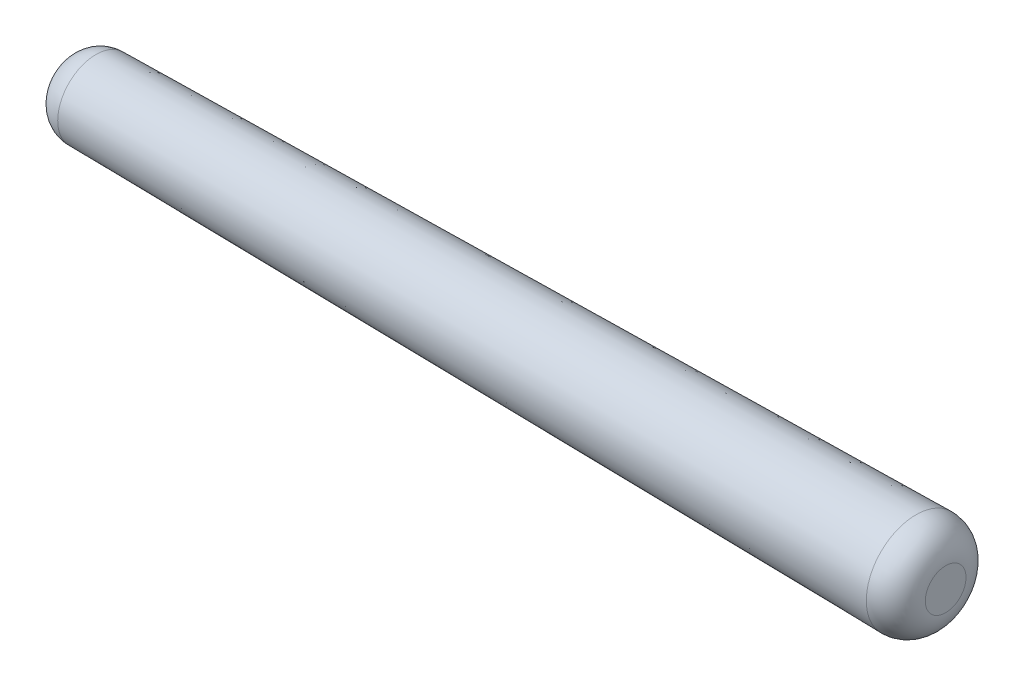
ISO-10303-21;
HEADER;
FILE_DESCRIPTION(('STEP AP214'),'2;1');
FILE_NAME('part.step','',(''),(''),'','','');
FILE_SCHEMA(('AUTOMOTIVE_DESIGN { 1 0 10303 214 1 1 1 1 }'));
ENDSEC;
DATA;
#1=APPLICATION_CONTEXT('core data for automotive mechanical design processes');
#2=APPLICATION_PROTOCOL_DEFINITION('international standard','automotive_design',2000,#1);
#3=PRODUCT_CONTEXT('',#1,'mechanical');
#4=PRODUCT('Part','Part','',(#3));
#5=PRODUCT_RELATED_PRODUCT_CATEGORY('part','',(#4));
#6=PRODUCT_DEFINITION_FORMATION('','',#4);
#7=PRODUCT_DEFINITION_CONTEXT('part definition',#1,'design');
#8=PRODUCT_DEFINITION('design','',#6,#7);
#9=PRODUCT_DEFINITION_SHAPE('','',#8);
#10=(LENGTH_UNIT() NAMED_UNIT(*) SI_UNIT(.MILLI.,.METRE.));
#11=(NAMED_UNIT(*) PLANE_ANGLE_UNIT() SI_UNIT($,.RADIAN.));
#12=(NAMED_UNIT(*) SI_UNIT($,.STERADIAN.) SOLID_ANGLE_UNIT());
#13=UNCERTAINTY_MEASURE_WITH_UNIT(LENGTH_MEASURE(1.E-05),#10,'distance_accuracy_value','');
#14=(GEOMETRIC_REPRESENTATION_CONTEXT(3) GLOBAL_UNCERTAINTY_ASSIGNED_CONTEXT((#13)) GLOBAL_UNIT_ASSIGNED_CONTEXT((#10,
#11,#12)) REPRESENTATION_CONTEXT('',''));
#15=CARTESIAN_POINT('',(0.,0.,0.));
#16=DIRECTION('',(0.,0.,1.));
#17=DIRECTION('',(1.,0.,0.));
#18=AXIS2_PLACEMENT_3D('',#15,#16,#17);
#19=CARTESIAN_POINT('',(6.,-0.683781248695046,0.));
#20=DIRECTION('',(-1.,0.,0.));
#21=DIRECTION('',(0.,-1.,0.));
#22=AXIS2_PLACEMENT_3D('',#19,#20,#21);
#23=PLANE('',#22);
#24=CARTESIAN_POINT('',(6.,0.,0.));
#25=DIRECTION('',(-1.,0.,0.));
#26=DIRECTION('',(0.,-1.,0.));
#27=AXIS2_PLACEMENT_3D('',#24,#25,#26);
#28=CIRCLE('',#27,0.278156837918102);
#29=CARTESIAN_POINT('',(6.,-0.2781568379181,0.));
#30=VERTEX_POINT('',#29);
#31=EDGE_CURVE('E10',#30,#30,#28,.F.);
#32=ORIENTED_EDGE('',*,*,#31,.T.);
#33=EDGE_LOOP('',(#32));
#34=FACE_BOUND('',#33,.T.);
#35=ADVANCED_FACE('F30',(#34),#23,.F.);
#36=CARTESIAN_POINT('',(-6.,0.,0.));
#37=DIRECTION('',(1.,0.,0.));
#38=DIRECTION('',(0.,1.,0.));
#39=AXIS2_PLACEMENT_3D('',#36,#37,#38);
#40=PLANE('',#39);
#41=CARTESIAN_POINT('',(-6.,0.,0.));
#42=DIRECTION('',(1.,0.,0.));
#43=DIRECTION('',(0.,1.,0.));
#44=AXIS2_PLACEMENT_3D('',#41,#42,#43);
#45=CIRCLE('',#44,0.121765173687346);
#46=CARTESIAN_POINT('',(-6.,0.121765173687345,0.));
#47=VERTEX_POINT('',#46);
#48=EDGE_CURVE('E37',#47,#47,#45,.F.);
#49=ORIENTED_EDGE('',*,*,#48,.T.);
#50=EDGE_LOOP('',(#49));
#51=FACE_BOUND('',#50,.T.);
#52=ADVANCED_FACE('F61',(#51),#40,.F.);
#53=CARTESIAN_POINT('',(-6.,0.,0.));
#54=DIRECTION('',(1.,0.,0.));
#55=DIRECTION('',(0.,1.,0.));
#56=AXIS2_PLACEMENT_3D('',#53,#54,#55);
#57=CONICAL_SURFACE('',#56,0.516218751304953,0.0139626340159476);
#58=CARTESIAN_POINT('',(-5.60558487213565,0.,0.));
#59=DIRECTION('',(-1.,0.,0.));
#60=DIRECTION('',(0.,-1.,0.));
#61=AXIS2_PLACEMENT_3D('',#58,#59,#60);
#62=CIRCLE('',#61,0.521726183291068);
#63=CARTESIAN_POINT('',(-5.60558487213565,-0.521726183291069,0.));
#64=VERTEX_POINT('',#63);
#65=EDGE_CURVE('E41',#64,#64,#62,.F.);
#66=ORIENTED_EDGE('',*,*,#65,.T.);
#67=EDGE_LOOP('',(#66));
#68=FACE_BOUND('',#67,.T.);
#69=CARTESIAN_POINT('',(5.59441512786436,0.,0.));
#70=DIRECTION('',(-1.,0.,0.));
#71=DIRECTION('',(0.,-1.,0.));
#72=AXIS2_PLACEMENT_3D('',#69,#70,#71);
#73=CIRCLE('',#72,0.678117847521824);
#74=CARTESIAN_POINT('',(5.59441512786436,-0.678117847521822,0.));
#75=VERTEX_POINT('',#74);
#76=EDGE_CURVE('E45',#75,#75,#73,.T.);
#77=ORIENTED_EDGE('',*,*,#76,.T.);
#78=EDGE_LOOP('',(#77));
#79=FACE_BOUND('',#78,.T.);
#80=ADVANCED_FACE('F51',(#68,#79),#57,.T.);
#81=CARTESIAN_POINT('',(-5.6,0.,0.));
#82=DIRECTION('',(1.,0.,0.));
#83=DIRECTION('',(0.,1.,0.));
#84=AXIS2_PLACEMENT_3D('',#81,#82,#83);
#85=DEGENERATE_TOROIDAL_SURFACE('',#84,0.121765173687346,0.4,.T.);
#86=ORIENTED_EDGE('',*,*,#48,.F.);
#87=EDGE_LOOP('',(#86));
#88=FACE_BOUND('',#87,.T.);
#89=ORIENTED_EDGE('',*,*,#65,.F.);
#90=EDGE_LOOP('',(#89));
#91=FACE_BOUND('',#90,.T.);
#92=ADVANCED_FACE('F55',(#88,#91),#85,.T.);
#93=CARTESIAN_POINT('',(5.6,0.,0.));
#94=DIRECTION('',(-1.,0.,0.));
#95=DIRECTION('',(0.,-1.,0.));
#96=AXIS2_PLACEMENT_3D('',#93,#94,#95);
#97=DEGENERATE_TOROIDAL_SURFACE('',#96,0.278156837918102,0.4,.T.);
#98=ORIENTED_EDGE('',*,*,#76,.F.);
#99=EDGE_LOOP('',(#98));
#100=FACE_BOUND('',#99,.T.);
#101=ORIENTED_EDGE('',*,*,#31,.F.);
#102=EDGE_LOOP('',(#101));
#103=FACE_BOUND('',#102,.T.);
#104=ADVANCED_FACE('F32',(#100,#103),#97,.T.);
#105=CLOSED_SHELL('',(#35,#52,#80,#92,#104));
#106=MANIFOLD_SOLID_BREP('B2',#105);
#107=ADVANCED_BREP_SHAPE_REPRESENTATION('',(#18,#106),#14);
#108=SHAPE_DEFINITION_REPRESENTATION(#9,#107);
ENDSEC;
END-ISO-10303-21;
